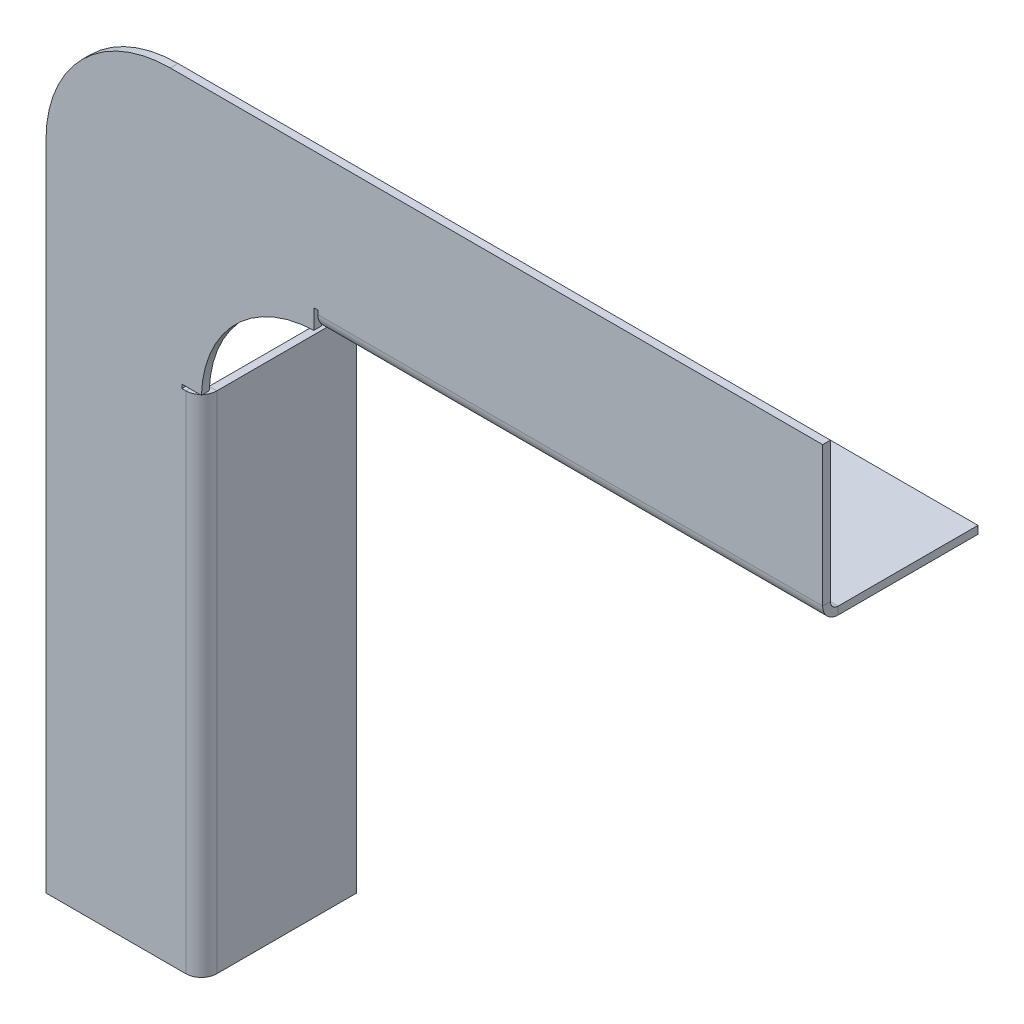
ISO-10303-21;
HEADER;
FILE_DESCRIPTION(('STEP AP214'),'2;1');
FILE_NAME('part.step','',(''),(''),'','','');
FILE_SCHEMA(('AUTOMOTIVE_DESIGN { 1 0 10303 214 1 1 1 1 }'));
ENDSEC;
DATA;
#1=APPLICATION_CONTEXT('core data for automotive mechanical design processes');
#2=APPLICATION_PROTOCOL_DEFINITION('international standard','automotive_design',2000,#1);
#3=PRODUCT_CONTEXT('',#1,'mechanical');
#4=PRODUCT('Part','Part','',(#3));
#5=PRODUCT_RELATED_PRODUCT_CATEGORY('part','',(#4));
#6=PRODUCT_DEFINITION_FORMATION('','',#4);
#7=PRODUCT_DEFINITION_CONTEXT('part definition',#1,'design');
#8=PRODUCT_DEFINITION('design','',#6,#7);
#9=PRODUCT_DEFINITION_SHAPE('','',#8);
#10=(LENGTH_UNIT() NAMED_UNIT(*) SI_UNIT(.MILLI.,.METRE.));
#11=(NAMED_UNIT(*) PLANE_ANGLE_UNIT() SI_UNIT($,.RADIAN.));
#12=(NAMED_UNIT(*) SI_UNIT($,.STERADIAN.) SOLID_ANGLE_UNIT());
#13=UNCERTAINTY_MEASURE_WITH_UNIT(LENGTH_MEASURE(1.E-05),#10,'distance_accuracy_value','');
#14=(GEOMETRIC_REPRESENTATION_CONTEXT(3) GLOBAL_UNCERTAINTY_ASSIGNED_CONTEXT((#13)) GLOBAL_UNIT_ASSIGNED_CONTEXT((#10,
#11,#12)) REPRESENTATION_CONTEXT('',''));
#15=CARTESIAN_POINT('',(0.,0.,0.));
#16=DIRECTION('',(0.,0.,1.));
#17=DIRECTION('',(1.,0.,0.));
#18=AXIS2_PLACEMENT_3D('',#15,#16,#17);
#19=CARTESIAN_POINT('',(19.,-19.,-1.));
#20=DIRECTION('',(0.,0.,1.));
#21=DIRECTION('',(1.,0.,0.));
#22=AXIS2_PLACEMENT_3D('',#19,#20,#21);
#23=CYLINDRICAL_SURFACE('',#22,15.);
#24=CARTESIAN_POINT('',(19.,-19.,0.));
#25=DIRECTION('',(0.,0.,-1.));
#26=DIRECTION('',(1.,0.,0.));
#27=AXIS2_PLACEMENT_3D('',#24,#25,#26);
#28=CIRCLE('',#27,15.);
#29=CARTESIAN_POINT('',(4.00833564943506,-18.5,0.));
#30=VERTEX_POINT('',#29);
#31=CARTESIAN_POINT('',(18.5,-4.00833564943506,0.));
#32=VERTEX_POINT('',#31);
#33=EDGE_CURVE('E471',#30,#32,#28,.T.);
#34=ORIENTED_EDGE('',*,*,#33,.F.);
#35=DIRECTION('',(0.,0.,1.));
#36=VECTOR('',#35,1.);
#37=CARTESIAN_POINT('',(4.00833564943506,-18.5,-1.));
#38=LINE('',#37,#36);
#39=CARTESIAN_POINT('',(4.00833564943506,-18.5,-1.));
#40=VERTEX_POINT('',#39);
#41=EDGE_CURVE('E407',#40,#30,#38,.T.);
#42=ORIENTED_EDGE('',*,*,#41,.F.);
#43=CARTESIAN_POINT('',(19.,-19.,-1.));
#44=DIRECTION('',(0.,0.,-1.));
#45=DIRECTION('',(1.,0.,0.));
#46=AXIS2_PLACEMENT_3D('',#43,#44,#45);
#47=CIRCLE('',#46,15.);
#48=CARTESIAN_POINT('',(18.5,-4.00833564943506,-1.));
#49=VERTEX_POINT('',#48);
#50=EDGE_CURVE('E451',#40,#49,#47,.T.);
#51=ORIENTED_EDGE('',*,*,#50,.T.);
#52=DIRECTION('',(0.,0.,1.));
#53=VECTOR('',#52,1.);
#54=CARTESIAN_POINT('',(18.5,-4.00833564943506,-1.));
#55=LINE('',#54,#53);
#56=EDGE_CURVE('E421',#49,#32,#55,.T.);
#57=ORIENTED_EDGE('',*,*,#56,.T.);
#58=EDGE_LOOP('',(#34,#42,#51,#57));
#59=FACE_BOUND('',#58,.T.);
#60=ADVANCED_FACE('F80',(#59),#23,.F.);
#61=CARTESIAN_POINT('',(0.,0.,-1.));
#62=DIRECTION('',(0.,0.,1.));
#63=DIRECTION('',(1.,0.,0.));
#64=AXIS2_PLACEMENT_3D('',#61,#62,#63);
#65=PLANE('',#64);
#66=DIRECTION('',(0.,-1.,0.));
#67=VECTOR('',#66,1.);
#68=CARTESIAN_POINT('',(2.00000000000001,-84.,-1.));
#69=LINE('',#68,#67);
#70=CARTESIAN_POINT('',(2.00000000000001,-84.,-1.));
#71=VERTEX_POINT('',#70);
#72=CARTESIAN_POINT('',(2.00000000000001,-19.,-1.));
#73=VERTEX_POINT('',#72);
#74=EDGE_CURVE('E309',#71,#73,#69,.F.);
#75=ORIENTED_EDGE('',*,*,#74,.F.);
#76=DIRECTION('',(1.,0.,0.));
#77=VECTOR('',#76,1.);
#78=CARTESIAN_POINT('',(-16.,-84.,-1.));
#79=LINE('',#78,#77);
#80=CARTESIAN_POINT('',(-16.,-84.,-1.));
#81=VERTEX_POINT('',#80);
#82=EDGE_CURVE('E447',#81,#71,#79,.T.);
#83=ORIENTED_EDGE('',*,*,#82,.F.);
#84=DIRECTION('',(0.,-1.,0.));
#85=VECTOR('',#84,1.);
#86=CARTESIAN_POINT('',(-16.,0.,-1.));
#87=LINE('',#86,#85);
#88=CARTESIAN_POINT('',(-16.,0.,-1.));
#89=VERTEX_POINT('',#88);
#90=EDGE_CURVE('E443',#89,#81,#87,.T.);
#91=ORIENTED_EDGE('',*,*,#90,.F.);
#92=CARTESIAN_POINT('',(0.,0.,-1.));
#93=DIRECTION('',(0.,0.,1.));
#94=DIRECTION('',(1.,0.,0.));
#95=AXIS2_PLACEMENT_3D('',#92,#93,#94);
#96=CIRCLE('',#95,16.);
#97=CARTESIAN_POINT('',(0.,16.,-1.));
#98=VERTEX_POINT('',#97);
#99=EDGE_CURVE('E440',#98,#89,#96,.T.);
#100=ORIENTED_EDGE('',*,*,#99,.F.);
#101=DIRECTION('',(-1.,0.,0.));
#102=VECTOR('',#101,1.);
#103=CARTESIAN_POINT('',(0.,16.,-1.));
#104=LINE('',#103,#102);
#105=CARTESIAN_POINT('',(84.,16.,-1.));
#106=VERTEX_POINT('',#105);
#107=EDGE_CURVE('E457',#106,#98,#104,.T.);
#108=ORIENTED_EDGE('',*,*,#107,.F.);
#109=DIRECTION('',(0.,1.,0.));
#110=VECTOR('',#109,1.);
#111=CARTESIAN_POINT('',(84.,16.,-1.));
#112=LINE('',#111,#110);
#113=CARTESIAN_POINT('',(84.,-2.00000000000001,-1.));
#114=VERTEX_POINT('',#113);
#115=EDGE_CURVE('E454',#114,#106,#112,.T.);
#116=ORIENTED_EDGE('',*,*,#115,.F.);
#117=DIRECTION('',(-1.,0.,0.));
#118=VECTOR('',#117,1.);
#119=CARTESIAN_POINT('',(19.,-2.00000000000001,-1.));
#120=LINE('',#119,#118);
#121=CARTESIAN_POINT('',(19.,-2.00000000000001,-1.));
#122=VERTEX_POINT('',#121);
#123=EDGE_CURVE('E381',#122,#114,#120,.F.);
#124=ORIENTED_EDGE('',*,*,#123,.F.);
#125=DIRECTION('',(0.,-1.,0.));
#126=VECTOR('',#125,1.);
#127=CARTESIAN_POINT('',(19.,-1.50000000000001,-1.));
#128=LINE('',#127,#126);
#129=CARTESIAN_POINT('',(19.,-1.50000000000001,-1.));
#130=VERTEX_POINT('',#129);
#131=EDGE_CURVE('E427',#130,#122,#128,.T.);
#132=ORIENTED_EDGE('',*,*,#131,.F.);
#133=DIRECTION('',(1.,0.,0.));
#134=VECTOR('',#133,1.);
#135=CARTESIAN_POINT('',(18.5,-1.50000000000001,-1.));
#136=LINE('',#135,#134);
#137=CARTESIAN_POINT('',(18.5,-1.50000000000001,-1.));
#138=VERTEX_POINT('',#137);
#139=EDGE_CURVE('E422',#138,#130,#136,.T.);
#140=ORIENTED_EDGE('',*,*,#139,.F.);
#141=DIRECTION('',(0.,1.,0.));
#142=VECTOR('',#141,1.);
#143=CARTESIAN_POINT('',(18.5,-4.00833564943506,-1.));
#144=LINE('',#143,#142);
#145=EDGE_CURVE('E416',#49,#138,#144,.T.);
#146=ORIENTED_EDGE('',*,*,#145,.F.);
#147=ORIENTED_EDGE('',*,*,#50,.F.);
#148=DIRECTION('',(1.,0.,0.));
#149=VECTOR('',#148,1.);
#150=CARTESIAN_POINT('',(1.50000000000001,-18.5,-1.));
#151=LINE('',#150,#149);
#152=CARTESIAN_POINT('',(1.50000000000001,-18.5,-1.));
#153=VERTEX_POINT('',#152);
#154=EDGE_CURVE('E404',#153,#40,#151,.T.);
#155=ORIENTED_EDGE('',*,*,#154,.F.);
#156=DIRECTION('',(0.,1.,0.));
#157=VECTOR('',#156,1.);
#158=CARTESIAN_POINT('',(1.50000000000001,-19.,-1.));
#159=LINE('',#158,#157);
#160=CARTESIAN_POINT('',(1.50000000000001,-19.,-1.));
#161=VERTEX_POINT('',#160);
#162=EDGE_CURVE('E399',#161,#153,#159,.T.);
#163=ORIENTED_EDGE('',*,*,#162,.F.);
#164=DIRECTION('',(-1.,0.,0.));
#165=VECTOR('',#164,1.);
#166=CARTESIAN_POINT('',(2.00000000000001,-19.,-1.));
#167=LINE('',#166,#165);
#168=EDGE_CURVE('E394',#73,#161,#167,.T.);
#169=ORIENTED_EDGE('',*,*,#168,.F.);
#170=EDGE_LOOP('',(#75,#83,#91,#100,#108,#116,#124,#132,#140,#146,#147,#155,#163,#169));
#171=FACE_BOUND('',#170,.T.);
#172=ADVANCED_FACE('F522',(#171),#65,.F.);
#173=CARTESIAN_POINT('',(0.,0.,0.));
#174=DIRECTION('',(0.,0.,1.));
#175=DIRECTION('',(1.,0.,0.));
#176=AXIS2_PLACEMENT_3D('',#173,#174,#175);
#177=PLANE('',#176);
#178=DIRECTION('',(1.,0.,0.));
#179=VECTOR('',#178,1.);
#180=CARTESIAN_POINT('',(-16.,-84.,0.));
#181=LINE('',#180,#179);
#182=CARTESIAN_POINT('',(-16.,-84.,0.));
#183=VERTEX_POINT('',#182);
#184=CARTESIAN_POINT('',(2.00000000000001,-84.,0.));
#185=VERTEX_POINT('',#184);
#186=EDGE_CURVE('E467',#183,#185,#181,.T.);
#187=ORIENTED_EDGE('',*,*,#186,.T.);
#188=DIRECTION('',(0.,-1.,0.));
#189=VECTOR('',#188,1.);
#190=CARTESIAN_POINT('',(2.00000000000001,-84.,0.));
#191=LINE('',#190,#189);
#192=CARTESIAN_POINT('',(2.00000000000001,-19.,0.));
#193=VERTEX_POINT('',#192);
#194=EDGE_CURVE('E292',#185,#193,#191,.F.);
#195=ORIENTED_EDGE('',*,*,#194,.T.);
#196=DIRECTION('',(-1.,0.,0.));
#197=VECTOR('',#196,1.);
#198=CARTESIAN_POINT('',(0.,-19.,0.));
#199=LINE('',#198,#197);
#200=CARTESIAN_POINT('',(1.50000000000001,-19.,0.));
#201=VERTEX_POINT('',#200);
#202=EDGE_CURVE('E13',#193,#201,#199,.T.);
#203=ORIENTED_EDGE('',*,*,#202,.T.);
#204=DIRECTION('',(0.,1.,0.));
#205=VECTOR('',#204,1.);
#206=CARTESIAN_POINT('',(1.50000000000001,0.,0.));
#207=LINE('',#206,#205);
#208=CARTESIAN_POINT('',(1.50000000000001,-18.5,0.));
#209=VERTEX_POINT('',#208);
#210=EDGE_CURVE('E89',#201,#209,#207,.T.);
#211=ORIENTED_EDGE('',*,*,#210,.T.);
#212=DIRECTION('',(1.,0.,0.));
#213=VECTOR('',#212,1.);
#214=CARTESIAN_POINT('',(0.,-18.5,0.));
#215=LINE('',#214,#213);
#216=EDGE_CURVE('E503',#209,#30,#215,.T.);
#217=ORIENTED_EDGE('',*,*,#216,.T.);
#218=ORIENTED_EDGE('',*,*,#33,.T.);
#219=DIRECTION('',(0.,1.,0.));
#220=VECTOR('',#219,1.);
#221=CARTESIAN_POINT('',(18.5,0.,0.));
#222=LINE('',#221,#220);
#223=CARTESIAN_POINT('',(18.5,-1.50000000000001,0.));
#224=VERTEX_POINT('',#223);
#225=EDGE_CURVE('E499',#32,#224,#222,.T.);
#226=ORIENTED_EDGE('',*,*,#225,.T.);
#227=DIRECTION('',(1.,0.,0.));
#228=VECTOR('',#227,1.);
#229=CARTESIAN_POINT('',(0.,-1.50000000000001,0.));
#230=LINE('',#229,#228);
#231=CARTESIAN_POINT('',(19.,-1.50000000000001,0.));
#232=VERTEX_POINT('',#231);
#233=EDGE_CURVE('E495',#224,#232,#230,.T.);
#234=ORIENTED_EDGE('',*,*,#233,.T.);
#235=DIRECTION('',(0.,-1.,0.));
#236=VECTOR('',#235,1.);
#237=CARTESIAN_POINT('',(19.,0.,0.));
#238=LINE('',#237,#236);
#239=CARTESIAN_POINT('',(19.,-2.00000000000002,0.));
#240=VERTEX_POINT('',#239);
#241=EDGE_CURVE('E482',#232,#240,#238,.T.);
#242=ORIENTED_EDGE('',*,*,#241,.T.);
#243=DIRECTION('',(-1.,0.,0.));
#244=VECTOR('',#243,1.);
#245=CARTESIAN_POINT('',(19.,-2.00000000000002,0.));
#246=LINE('',#245,#244);
#247=CARTESIAN_POINT('',(84.,-2.00000000000001,0.));
#248=VERTEX_POINT('',#247);
#249=EDGE_CURVE('E366',#240,#248,#246,.F.);
#250=ORIENTED_EDGE('',*,*,#249,.T.);
#251=DIRECTION('',(0.,1.,0.));
#252=VECTOR('',#251,1.);
#253=CARTESIAN_POINT('',(84.,16.,0.));
#254=LINE('',#253,#252);
#255=CARTESIAN_POINT('',(84.,16.,0.));
#256=VERTEX_POINT('',#255);
#257=EDGE_CURVE('E474',#248,#256,#254,.T.);
#258=ORIENTED_EDGE('',*,*,#257,.T.);
#259=DIRECTION('',(-1.,0.,0.));
#260=VECTOR('',#259,1.);
#261=CARTESIAN_POINT('',(0.,16.,0.));
#262=LINE('',#261,#260);
#263=CARTESIAN_POINT('',(0.,16.,0.));
#264=VERTEX_POINT('',#263);
#265=EDGE_CURVE('E444',#256,#264,#262,.T.);
#266=ORIENTED_EDGE('',*,*,#265,.T.);
#267=CARTESIAN_POINT('',(0.,0.,0.));
#268=DIRECTION('',(0.,0.,1.));
#269=DIRECTION('',(1.,0.,0.));
#270=AXIS2_PLACEMENT_3D('',#267,#268,#269);
#271=CIRCLE('',#270,16.);
#272=CARTESIAN_POINT('',(-16.,0.,0.));
#273=VERTEX_POINT('',#272);
#274=EDGE_CURVE('E420',#264,#273,#271,.T.);
#275=ORIENTED_EDGE('',*,*,#274,.T.);
#276=DIRECTION('',(0.,-1.,0.));
#277=VECTOR('',#276,1.);
#278=CARTESIAN_POINT('',(-16.,0.,0.));
#279=LINE('',#278,#277);
#280=EDGE_CURVE('E463',#273,#183,#279,.T.);
#281=ORIENTED_EDGE('',*,*,#280,.T.);
#282=EDGE_LOOP('',(#187,#195,#203,#211,#217,#218,#226,#234,#242,#250,#258,#266,#275,#281));
#283=FACE_BOUND('',#282,.T.);
#284=ADVANCED_FACE('F509',(#283),#177,.T.);
#285=CARTESIAN_POINT('',(-16.,-84.,-1.));
#286=DIRECTION('',(0.,-1.,0.));
#287=DIRECTION('',(0.,0.,-1.));
#288=AXIS2_PLACEMENT_3D('',#285,#286,#287);
#289=PLANE('',#288);
#290=ORIENTED_EDGE('',*,*,#82,.T.);
#291=DIRECTION('',(0.,0.,1.));
#292=VECTOR('',#291,1.);
#293=CARTESIAN_POINT('',(2.00000000000001,-84.,-1.));
#294=LINE('',#293,#292);
#295=EDGE_CURVE('E301',#71,#185,#294,.T.);
#296=ORIENTED_EDGE('',*,*,#295,.T.);
#297=ORIENTED_EDGE('',*,*,#186,.F.);
#298=DIRECTION('',(0.,0.,1.));
#299=VECTOR('',#298,1.);
#300=CARTESIAN_POINT('',(-16.,-84.,-1.));
#301=LINE('',#300,#299);
#302=EDGE_CURVE('E487',#81,#183,#301,.T.);
#303=ORIENTED_EDGE('',*,*,#302,.F.);
#304=EDGE_LOOP('',(#290,#296,#297,#303));
#305=FACE_BOUND('',#304,.T.);
#306=ADVANCED_FACE('F582',(#305),#289,.T.);
#307=CARTESIAN_POINT('',(0.,0.,-1.));
#308=DIRECTION('',(0.,0.,1.));
#309=DIRECTION('',(1.,0.,0.));
#310=AXIS2_PLACEMENT_3D('',#307,#308,#309);
#311=CYLINDRICAL_SURFACE('',#310,16.);
#312=ORIENTED_EDGE('',*,*,#274,.F.);
#313=DIRECTION('',(0.,0.,1.));
#314=VECTOR('',#313,1.);
#315=CARTESIAN_POINT('',(0.,16.,-1.));
#316=LINE('',#315,#314);
#317=EDGE_CURVE('E105',#98,#264,#316,.T.);
#318=ORIENTED_EDGE('',*,*,#317,.F.);
#319=ORIENTED_EDGE('',*,*,#99,.T.);
#320=DIRECTION('',(0.,0.,1.));
#321=VECTOR('',#320,1.);
#322=CARTESIAN_POINT('',(-16.,0.,-1.));
#323=LINE('',#322,#321);
#324=EDGE_CURVE('E131',#89,#273,#323,.T.);
#325=ORIENTED_EDGE('',*,*,#324,.T.);
#326=EDGE_LOOP('',(#312,#318,#319,#325));
#327=FACE_BOUND('',#326,.T.);
#328=ADVANCED_FACE('F82',(#327),#311,.T.);
#329=CARTESIAN_POINT('',(0.,16.,-1.));
#330=DIRECTION('',(0.,1.,0.));
#331=DIRECTION('',(0.,0.,1.));
#332=AXIS2_PLACEMENT_3D('',#329,#330,#331);
#333=PLANE('',#332);
#334=ORIENTED_EDGE('',*,*,#265,.F.);
#335=DIRECTION('',(0.,0.,1.));
#336=VECTOR('',#335,1.);
#337=CARTESIAN_POINT('',(84.,16.,-1.));
#338=LINE('',#337,#336);
#339=EDGE_CURVE('E483',#106,#256,#338,.T.);
#340=ORIENTED_EDGE('',*,*,#339,.F.);
#341=ORIENTED_EDGE('',*,*,#107,.T.);
#342=ORIENTED_EDGE('',*,*,#317,.T.);
#343=EDGE_LOOP('',(#334,#340,#341,#342));
#344=FACE_BOUND('',#343,.T.);
#345=ADVANCED_FACE('F577',(#344),#333,.T.);
#346=CARTESIAN_POINT('',(84.,16.,-1.));
#347=DIRECTION('',(1.,0.,0.));
#348=DIRECTION('',(0.,0.,-1.));
#349=AXIS2_PLACEMENT_3D('',#346,#347,#348);
#350=PLANE('',#349);
#351=DIRECTION('',(0.,0.,1.));
#352=VECTOR('',#351,1.);
#353=CARTESIAN_POINT('',(84.,-2.00000000000001,-1.));
#354=LINE('',#353,#352);
#355=EDGE_CURVE('E387',#114,#248,#354,.T.);
#356=ORIENTED_EDGE('',*,*,#355,.F.);
#357=ORIENTED_EDGE('',*,*,#115,.T.);
#358=ORIENTED_EDGE('',*,*,#339,.T.);
#359=ORIENTED_EDGE('',*,*,#257,.F.);
#360=EDGE_LOOP('',(#356,#357,#358,#359));
#361=FACE_BOUND('',#360,.T.);
#362=ADVANCED_FACE('F574',(#361),#350,.T.);
#363=CARTESIAN_POINT('',(-16.,0.,-1.));
#364=DIRECTION('',(-1.,0.,0.));
#365=DIRECTION('',(0.,-1.,0.));
#366=AXIS2_PLACEMENT_3D('',#363,#364,#365);
#367=PLANE('',#366);
#368=ORIENTED_EDGE('',*,*,#280,.F.);
#369=ORIENTED_EDGE('',*,*,#324,.F.);
#370=ORIENTED_EDGE('',*,*,#90,.T.);
#371=ORIENTED_EDGE('',*,*,#302,.T.);
#372=EDGE_LOOP('',(#368,#369,#370,#371));
#373=FACE_BOUND('',#372,.T.);
#374=ADVANCED_FACE('F578',(#373),#367,.T.);
#375=CARTESIAN_POINT('',(18.5,-4.00833564943506,-1.));
#376=DIRECTION('',(1.,0.,0.));
#377=DIRECTION('',(0.,0.,-1.));
#378=AXIS2_PLACEMENT_3D('',#375,#376,#377);
#379=PLANE('',#378);
#380=ORIENTED_EDGE('',*,*,#225,.F.);
#381=ORIENTED_EDGE('',*,*,#56,.F.);
#382=ORIENTED_EDGE('',*,*,#145,.T.);
#383=DIRECTION('',(0.,0.,1.));
#384=VECTOR('',#383,1.);
#385=CARTESIAN_POINT('',(18.5,-1.50000000000001,-1.));
#386=LINE('',#385,#384);
#387=EDGE_CURVE('E426',#138,#224,#386,.T.);
#388=ORIENTED_EDGE('',*,*,#387,.T.);
#389=EDGE_LOOP('',(#380,#381,#382,#388));
#390=FACE_BOUND('',#389,.T.);
#391=ADVANCED_FACE('F532',(#390),#379,.T.);
#392=CARTESIAN_POINT('',(18.5,-1.50000000000001,-1.));
#393=DIRECTION('',(0.,-1.,0.));
#394=DIRECTION('',(0.,0.,-1.));
#395=AXIS2_PLACEMENT_3D('',#392,#393,#394);
#396=PLANE('',#395);
#397=ORIENTED_EDGE('',*,*,#233,.F.);
#398=ORIENTED_EDGE('',*,*,#387,.F.);
#399=ORIENTED_EDGE('',*,*,#139,.T.);
#400=DIRECTION('',(0.,0.,1.));
#401=VECTOR('',#400,1.);
#402=CARTESIAN_POINT('',(19.,-1.50000000000001,-1.));
#403=LINE('',#402,#401);
#404=EDGE_CURVE('E398',#130,#232,#403,.T.);
#405=ORIENTED_EDGE('',*,*,#404,.T.);
#406=EDGE_LOOP('',(#397,#398,#399,#405));
#407=FACE_BOUND('',#406,.T.);
#408=ADVANCED_FACE('F535',(#407),#396,.T.);
#409=CARTESIAN_POINT('',(19.,-1.50000000000001,-1.));
#410=DIRECTION('',(-1.,0.,0.));
#411=DIRECTION('',(0.,0.,1.));
#412=AXIS2_PLACEMENT_3D('',#409,#410,#411);
#413=PLANE('',#412);
#414=ORIENTED_EDGE('',*,*,#241,.F.);
#415=ORIENTED_EDGE('',*,*,#404,.F.);
#416=ORIENTED_EDGE('',*,*,#131,.T.);
#417=DIRECTION('',(0.,0.,1.));
#418=VECTOR('',#417,1.);
#419=CARTESIAN_POINT('',(19.,-2.00000000000001,-1.));
#420=LINE('',#419,#418);
#421=EDGE_CURVE('E373',#122,#240,#420,.T.);
#422=ORIENTED_EDGE('',*,*,#421,.T.);
#423=EDGE_LOOP('',(#414,#415,#416,#422));
#424=FACE_BOUND('',#423,.T.);
#425=ADVANCED_FACE('F539',(#424),#413,.T.);
#426=CARTESIAN_POINT('',(2.00000000000001,-19.,-1.));
#427=DIRECTION('',(0.,1.,0.));
#428=DIRECTION('',(0.,0.,1.));
#429=AXIS2_PLACEMENT_3D('',#426,#427,#428);
#430=PLANE('',#429);
#431=ORIENTED_EDGE('',*,*,#202,.F.);
#432=DIRECTION('',(0.,0.,1.));
#433=VECTOR('',#432,1.);
#434=CARTESIAN_POINT('',(2.00000000000001,-19.,-1.));
#435=LINE('',#434,#433);
#436=EDGE_CURVE('E316',#73,#193,#435,.T.);
#437=ORIENTED_EDGE('',*,*,#436,.F.);
#438=ORIENTED_EDGE('',*,*,#168,.T.);
#439=DIRECTION('',(0.,0.,1.));
#440=VECTOR('',#439,1.);
#441=CARTESIAN_POINT('',(1.50000000000001,-19.,-1.));
#442=LINE('',#441,#440);
#443=EDGE_CURVE('E403',#161,#201,#442,.T.);
#444=ORIENTED_EDGE('',*,*,#443,.T.);
#445=EDGE_LOOP('',(#431,#437,#438,#444));
#446=FACE_BOUND('',#445,.T.);
#447=ADVANCED_FACE('F515',(#446),#430,.T.);
#448=CARTESIAN_POINT('',(1.50000000000001,-19.,-1.));
#449=DIRECTION('',(1.,0.,0.));
#450=DIRECTION('',(0.,0.,-1.));
#451=AXIS2_PLACEMENT_3D('',#448,#449,#450);
#452=PLANE('',#451);
#453=ORIENTED_EDGE('',*,*,#210,.F.);
#454=ORIENTED_EDGE('',*,*,#443,.F.);
#455=ORIENTED_EDGE('',*,*,#162,.T.);
#456=DIRECTION('',(0.,0.,1.));
#457=VECTOR('',#456,1.);
#458=CARTESIAN_POINT('',(1.50000000000001,-18.5,-1.));
#459=LINE('',#458,#457);
#460=EDGE_CURVE('E390',#153,#209,#459,.T.);
#461=ORIENTED_EDGE('',*,*,#460,.T.);
#462=EDGE_LOOP('',(#453,#454,#455,#461));
#463=FACE_BOUND('',#462,.T.);
#464=ADVANCED_FACE('F513',(#463),#452,.T.);
#465=CARTESIAN_POINT('',(1.50000000000001,-18.5,-1.));
#466=DIRECTION('',(0.,-1.,0.));
#467=DIRECTION('',(0.,0.,-1.));
#468=AXIS2_PLACEMENT_3D('',#465,#466,#467);
#469=PLANE('',#468);
#470=ORIENTED_EDGE('',*,*,#216,.F.);
#471=ORIENTED_EDGE('',*,*,#460,.F.);
#472=ORIENTED_EDGE('',*,*,#154,.T.);
#473=ORIENTED_EDGE('',*,*,#41,.T.);
#474=EDGE_LOOP('',(#470,#471,#472,#473));
#475=FACE_BOUND('',#474,.T.);
#476=ADVANCED_FACE('F527',(#475),#469,.T.);
#477=CARTESIAN_POINT('',(84.,-2.00000000000001,-2.));
#478=DIRECTION('',(1.,0.,0.));
#479=DIRECTION('',(0.,0.,-1.));
#480=AXIS2_PLACEMENT_3D('',#477,#478,#479);
#481=PLANE('',#480);
#482=DIRECTION('',(0.,1.,0.));
#483=VECTOR('',#482,1.);
#484=CARTESIAN_POINT('',(84.,-4.,-1.99999999999999));
#485=LINE('',#484,#483);
#486=CARTESIAN_POINT('',(84.,-3.,-1.99999999999999));
#487=VERTEX_POINT('',#486);
#488=CARTESIAN_POINT('',(84.,-4.,-1.99999999999999));
#489=VERTEX_POINT('',#488);
#490=EDGE_CURVE('E320',#487,#489,#485,.F.);
#491=ORIENTED_EDGE('',*,*,#490,.F.);
#492=CARTESIAN_POINT('',(84.,-2.00000000000001,-2.));
#493=DIRECTION('',(-1.,0.,0.));
#494=DIRECTION('',(0.,0.,1.));
#495=AXIS2_PLACEMENT_3D('',#492,#493,#494);
#496=CIRCLE('',#495,0.999999999999997);
#497=EDGE_CURVE('E377',#114,#487,#496,.F.);
#498=ORIENTED_EDGE('',*,*,#497,.F.);
#499=ORIENTED_EDGE('',*,*,#355,.T.);
#500=CARTESIAN_POINT('',(84.,-2.00000000000001,-2.));
#501=DIRECTION('',(-1.,0.,0.));
#502=DIRECTION('',(0.,0.,1.));
#503=AXIS2_PLACEMENT_3D('',#500,#501,#502);
#504=CIRCLE('',#503,2.);
#505=EDGE_CURVE('E96',#248,#489,#504,.F.);
#506=ORIENTED_EDGE('',*,*,#505,.T.);
#507=EDGE_LOOP('',(#491,#498,#499,#506));
#508=FACE_BOUND('',#507,.T.);
#509=ADVANCED_FACE('F570',(#508),#481,.T.);
#510=CARTESIAN_POINT('',(19.,-2.00000000000001,-2.));
#511=DIRECTION('',(1.,0.,0.));
#512=DIRECTION('',(0.,0.,-1.));
#513=AXIS2_PLACEMENT_3D('',#510,#511,#512);
#514=PLANE('',#513);
#515=CARTESIAN_POINT('',(19.,-2.00000000000001,-2.));
#516=DIRECTION('',(-1.,0.,0.));
#517=DIRECTION('',(0.,0.,1.));
#518=AXIS2_PLACEMENT_3D('',#515,#516,#517);
#519=CIRCLE('',#518,0.999999999999997);
#520=CARTESIAN_POINT('',(19.,-3.,-1.99999999999999));
#521=VERTEX_POINT('',#520);
#522=EDGE_CURVE('E328',#521,#122,#519,.T.);
#523=ORIENTED_EDGE('',*,*,#522,.F.);
#524=DIRECTION('',(0.,1.,0.));
#525=VECTOR('',#524,1.);
#526=CARTESIAN_POINT('',(19.,-3.00000000000001,-1.99999999999999));
#527=LINE('',#526,#525);
#528=CARTESIAN_POINT('',(19.,-4.00000000000001,-1.99999999999999));
#529=VERTEX_POINT('',#528);
#530=EDGE_CURVE('E356',#521,#529,#527,.F.);
#531=ORIENTED_EDGE('',*,*,#530,.T.);
#532=CARTESIAN_POINT('',(19.,-2.00000000000001,-2.));
#533=DIRECTION('',(-1.,0.,0.));
#534=DIRECTION('',(0.,0.,1.));
#535=AXIS2_PLACEMENT_3D('',#532,#533,#534);
#536=CIRCLE('',#535,2.);
#537=EDGE_CURVE('E370',#529,#240,#536,.T.);
#538=ORIENTED_EDGE('',*,*,#537,.T.);
#539=ORIENTED_EDGE('',*,*,#421,.F.);
#540=EDGE_LOOP('',(#523,#531,#538,#539));
#541=FACE_BOUND('',#540,.T.);
#542=ADVANCED_FACE('F543',(#541),#514,.F.);
#543=CARTESIAN_POINT('',(19.,-2.00000000000001,-2.));
#544=DIRECTION('',(-1.,0.,0.));
#545=DIRECTION('',(0.,-1.,0.));
#546=AXIS2_PLACEMENT_3D('',#543,#544,#545);
#547=CYLINDRICAL_SURFACE('',#546,2.);
#548=ORIENTED_EDGE('',*,*,#249,.F.);
#549=ORIENTED_EDGE('',*,*,#537,.F.);
#550=DIRECTION('',(-1.,0.,0.));
#551=VECTOR('',#550,1.);
#552=CARTESIAN_POINT('',(84.,-4.,-1.99999999999999));
#553=LINE('',#552,#551);
#554=EDGE_CURVE('E353',#529,#489,#553,.F.);
#555=ORIENTED_EDGE('',*,*,#554,.T.);
#556=ORIENTED_EDGE('',*,*,#505,.F.);
#557=EDGE_LOOP('',(#548,#549,#555,#556));
#558=FACE_BOUND('',#557,.T.);
#559=ADVANCED_FACE('F568',(#558),#547,.T.);
#560=CARTESIAN_POINT('',(19.,-2.00000000000001,-2.));
#561=DIRECTION('',(-1.,0.,0.));
#562=DIRECTION('',(0.,-1.,0.));
#563=AXIS2_PLACEMENT_3D('',#560,#561,#562);
#564=CYLINDRICAL_SURFACE('',#563,0.999999999999997);
#565=ORIENTED_EDGE('',*,*,#123,.T.);
#566=ORIENTED_EDGE('',*,*,#497,.T.);
#567=DIRECTION('',(-1.,0.,0.));
#568=VECTOR('',#567,1.);
#569=CARTESIAN_POINT('',(84.,-3.,-2.));
#570=LINE('',#569,#568);
#571=EDGE_CURVE('E360',#487,#521,#570,.T.);
#572=ORIENTED_EDGE('',*,*,#571,.T.);
#573=ORIENTED_EDGE('',*,*,#522,.T.);
#574=EDGE_LOOP('',(#565,#566,#572,#573));
#575=FACE_BOUND('',#574,.T.);
#576=ADVANCED_FACE('F546',(#575),#564,.F.);
#577=CARTESIAN_POINT('',(19.,-4.00000000000007,-20.));
#578=DIRECTION('',(1.,0.,0.));
#579=DIRECTION('',(0.,0.,-1.));
#580=AXIS2_PLACEMENT_3D('',#577,#578,#579);
#581=PLANE('',#580);
#582=ORIENTED_EDGE('',*,*,#530,.F.);
#583=DIRECTION('',(0.,0.,1.));
#584=VECTOR('',#583,1.);
#585=CARTESIAN_POINT('',(19.,-3.00000000000007,-20.));
#586=LINE('',#585,#584);
#587=CARTESIAN_POINT('',(19.,-3.00000000000007,-20.));
#588=VERTEX_POINT('',#587);
#589=EDGE_CURVE('E350',#521,#588,#586,.F.);
#590=ORIENTED_EDGE('',*,*,#589,.T.);
#591=DIRECTION('',(0.,1.,0.));
#592=VECTOR('',#591,1.);
#593=CARTESIAN_POINT('',(19.,-4.00000000000007,-20.));
#594=LINE('',#593,#592);
#595=CARTESIAN_POINT('',(19.,-4.00000000000007,-20.));
#596=VERTEX_POINT('',#595);
#597=EDGE_CURVE('E324',#596,#588,#594,.T.);
#598=ORIENTED_EDGE('',*,*,#597,.F.);
#599=DIRECTION('',(0.,0.,-1.));
#600=VECTOR('',#599,1.);
#601=CARTESIAN_POINT('',(19.,-4.,0.));
#602=LINE('',#601,#600);
#603=EDGE_CURVE('E340',#529,#596,#602,.T.);
#604=ORIENTED_EDGE('',*,*,#603,.F.);
#605=EDGE_LOOP('',(#582,#590,#598,#604));
#606=FACE_BOUND('',#605,.T.);
#607=ADVANCED_FACE('F564',(#606),#581,.F.);
#608=CARTESIAN_POINT('',(84.,-4.,-0.999999999999997));
#609=DIRECTION('',(-1.,0.,0.));
#610=DIRECTION('',(0.,-1.,0.));
#611=AXIS2_PLACEMENT_3D('',#608,#609,#610);
#612=PLANE('',#611);
#613=ORIENTED_EDGE('',*,*,#490,.T.);
#614=DIRECTION('',(0.,0.,1.));
#615=VECTOR('',#614,1.);
#616=CARTESIAN_POINT('',(84.,-4.,0.));
#617=LINE('',#616,#615);
#618=CARTESIAN_POINT('',(84.,-4.00000000000007,-20.));
#619=VERTEX_POINT('',#618);
#620=EDGE_CURVE('E333',#619,#489,#617,.T.);
#621=ORIENTED_EDGE('',*,*,#620,.F.);
#622=DIRECTION('',(0.,1.,0.));
#623=VECTOR('',#622,1.);
#624=CARTESIAN_POINT('',(84.,-4.00000000000007,-20.));
#625=LINE('',#624,#623);
#626=CARTESIAN_POINT('',(84.,-3.00000000000007,-20.));
#627=VERTEX_POINT('',#626);
#628=EDGE_CURVE('E329',#619,#627,#625,.T.);
#629=ORIENTED_EDGE('',*,*,#628,.T.);
#630=DIRECTION('',(0.,0.,-1.));
#631=VECTOR('',#630,1.);
#632=CARTESIAN_POINT('',(84.,-3.,-1.));
#633=LINE('',#632,#631);
#634=EDGE_CURVE('E343',#627,#487,#633,.F.);
#635=ORIENTED_EDGE('',*,*,#634,.T.);
#636=EDGE_LOOP('',(#613,#621,#629,#635));
#637=FACE_BOUND('',#636,.T.);
#638=ADVANCED_FACE('F555',(#637),#612,.F.);
#639=CARTESIAN_POINT('',(0.,-4.00000000000001,0.));
#640=DIRECTION('',(0.,1.,0.));
#641=DIRECTION('',(0.,0.,1.));
#642=AXIS2_PLACEMENT_3D('',#639,#640,#641);
#643=PLANE('',#642);
#644=ORIENTED_EDGE('',*,*,#554,.F.);
#645=ORIENTED_EDGE('',*,*,#603,.T.);
#646=DIRECTION('',(1.,0.,0.));
#647=VECTOR('',#646,1.);
#648=CARTESIAN_POINT('',(0.,-4.00000000000007,-20.));
#649=LINE('',#648,#647);
#650=EDGE_CURVE('E337',#596,#619,#649,.T.);
#651=ORIENTED_EDGE('',*,*,#650,.T.);
#652=ORIENTED_EDGE('',*,*,#620,.T.);
#653=EDGE_LOOP('',(#644,#645,#651,#652));
#654=FACE_BOUND('',#653,.T.);
#655=ADVANCED_FACE('F567',(#654),#643,.F.);
#656=CARTESIAN_POINT('',(0.,-3.00000000000001,0.));
#657=DIRECTION('',(0.,1.,0.));
#658=DIRECTION('',(0.,0.,1.));
#659=AXIS2_PLACEMENT_3D('',#656,#657,#658);
#660=PLANE('',#659);
#661=ORIENTED_EDGE('',*,*,#589,.F.);
#662=ORIENTED_EDGE('',*,*,#571,.F.);
#663=ORIENTED_EDGE('',*,*,#634,.F.);
#664=DIRECTION('',(-1.,0.,0.));
#665=VECTOR('',#664,1.);
#666=CARTESIAN_POINT('',(84.,-3.00000000000007,-20.));
#667=LINE('',#666,#665);
#668=EDGE_CURVE('E347',#588,#627,#667,.F.);
#669=ORIENTED_EDGE('',*,*,#668,.F.);
#670=EDGE_LOOP('',(#661,#662,#663,#669));
#671=FACE_BOUND('',#670,.T.);
#672=ADVANCED_FACE('F552',(#671),#660,.T.);
#673=CARTESIAN_POINT('',(84.,-4.00000000000007,-20.));
#674=DIRECTION('',(0.,0.,1.));
#675=DIRECTION('',(0.,-1.,0.));
#676=AXIS2_PLACEMENT_3D('',#673,#674,#675);
#677=PLANE('',#676);
#678=ORIENTED_EDGE('',*,*,#668,.T.);
#679=ORIENTED_EDGE('',*,*,#628,.F.);
#680=ORIENTED_EDGE('',*,*,#650,.F.);
#681=ORIENTED_EDGE('',*,*,#597,.T.);
#682=EDGE_LOOP('',(#678,#679,#680,#681));
#683=FACE_BOUND('',#682,.T.);
#684=ADVANCED_FACE('F560',(#683),#677,.F.);
#685=CARTESIAN_POINT('',(2.00000000000001,-19.,-2.));
#686=DIRECTION('',(0.,1.,0.));
#687=DIRECTION('',(0.,0.,1.));
#688=AXIS2_PLACEMENT_3D('',#685,#686,#687);
#689=PLANE('',#688);
#690=DIRECTION('',(-1.,0.,0.));
#691=VECTOR('',#690,1.);
#692=CARTESIAN_POINT('',(4.00000000000001,-19.,-1.99999999999999));
#693=LINE('',#692,#691);
#694=CARTESIAN_POINT('',(3.00000000000001,-19.,-2.));
#695=VERTEX_POINT('',#694);
#696=CARTESIAN_POINT('',(4.00000000000001,-19.,-1.99999999999999));
#697=VERTEX_POINT('',#696);
#698=EDGE_CURVE('E265',#695,#697,#693,.F.);
#699=ORIENTED_EDGE('',*,*,#698,.F.);
#700=CARTESIAN_POINT('',(2.00000000000001,-19.,-2.));
#701=DIRECTION('',(0.,-1.,0.));
#702=DIRECTION('',(0.,0.,-1.));
#703=AXIS2_PLACEMENT_3D('',#700,#701,#702);
#704=CIRCLE('',#703,1.);
#705=EDGE_CURVE('E305',#73,#695,#704,.F.);
#706=ORIENTED_EDGE('',*,*,#705,.F.);
#707=ORIENTED_EDGE('',*,*,#436,.T.);
#708=CARTESIAN_POINT('',(2.00000000000001,-19.,-2.));
#709=DIRECTION('',(0.,-1.,0.));
#710=DIRECTION('',(0.,0.,-1.));
#711=AXIS2_PLACEMENT_3D('',#708,#709,#710);
#712=CIRCLE('',#711,2.);
#713=EDGE_CURVE('E296',#193,#697,#712,.F.);
#714=ORIENTED_EDGE('',*,*,#713,.T.);
#715=EDGE_LOOP('',(#699,#706,#707,#714));
#716=FACE_BOUND('',#715,.T.);
#717=ADVANCED_FACE('F600',(#716),#689,.T.);
#718=CARTESIAN_POINT('',(2.00000000000001,-84.,-2.));
#719=DIRECTION('',(0.,1.,0.));
#720=DIRECTION('',(0.,0.,1.));
#721=AXIS2_PLACEMENT_3D('',#718,#719,#720);
#722=PLANE('',#721);
#723=CARTESIAN_POINT('',(2.00000000000001,-84.,-2.));
#724=DIRECTION('',(0.,-1.,0.));
#725=DIRECTION('',(0.,0.,-1.));
#726=AXIS2_PLACEMENT_3D('',#723,#724,#725);
#727=CIRCLE('',#726,1.);
#728=CARTESIAN_POINT('',(3.00000000000001,-84.,-2.));
#729=VERTEX_POINT('',#728);
#730=EDGE_CURVE('E312',#729,#71,#727,.T.);
#731=ORIENTED_EDGE('',*,*,#730,.F.);
#732=DIRECTION('',(-1.,0.,0.));
#733=VECTOR('',#732,1.);
#734=CARTESIAN_POINT('',(3.00000000000001,-84.,-2.));
#735=LINE('',#734,#733);
#736=CARTESIAN_POINT('',(4.00000000000001,-84.,-1.99999999999999));
#737=VERTEX_POINT('',#736);
#738=EDGE_CURVE('E283',#729,#737,#735,.F.);
#739=ORIENTED_EDGE('',*,*,#738,.T.);
#740=CARTESIAN_POINT('',(2.00000000000001,-84.,-2.));
#741=DIRECTION('',(0.,-1.,0.));
#742=DIRECTION('',(0.,0.,-1.));
#743=AXIS2_PLACEMENT_3D('',#740,#741,#742);
#744=CIRCLE('',#743,2.);
#745=EDGE_CURVE('E297',#737,#185,#744,.T.);
#746=ORIENTED_EDGE('',*,*,#745,.T.);
#747=ORIENTED_EDGE('',*,*,#295,.F.);
#748=EDGE_LOOP('',(#731,#739,#746,#747));
#749=FACE_BOUND('',#748,.T.);
#750=ADVANCED_FACE('F587',(#749),#722,.F.);
#751=CARTESIAN_POINT('',(2.00000000000001,-84.,-2.));
#752=DIRECTION('',(0.,-1.,0.));
#753=DIRECTION('',(1.,0.,0.));
#754=AXIS2_PLACEMENT_3D('',#751,#752,#753);
#755=CYLINDRICAL_SURFACE('',#754,2.);
#756=ORIENTED_EDGE('',*,*,#194,.F.);
#757=ORIENTED_EDGE('',*,*,#745,.F.);
#758=DIRECTION('',(0.,-1.,0.));
#759=VECTOR('',#758,1.);
#760=CARTESIAN_POINT('',(4.00000000000001,-19.,-1.99999999999999));
#761=LINE('',#760,#759);
#762=EDGE_CURVE('E280',#737,#697,#761,.F.);
#763=ORIENTED_EDGE('',*,*,#762,.T.);
#764=ORIENTED_EDGE('',*,*,#713,.F.);
#765=EDGE_LOOP('',(#756,#757,#763,#764));
#766=FACE_BOUND('',#765,.T.);
#767=ADVANCED_FACE('F584',(#766),#755,.T.);
#768=CARTESIAN_POINT('',(2.00000000000001,-84.,-2.));
#769=DIRECTION('',(0.,-1.,0.));
#770=DIRECTION('',(1.,0.,0.));
#771=AXIS2_PLACEMENT_3D('',#768,#769,#770);
#772=CYLINDRICAL_SURFACE('',#771,1.);
#773=ORIENTED_EDGE('',*,*,#74,.T.);
#774=ORIENTED_EDGE('',*,*,#705,.T.);
#775=DIRECTION('',(0.,-1.,0.));
#776=VECTOR('',#775,1.);
#777=CARTESIAN_POINT('',(3.00000000000001,-19.,-2.));
#778=LINE('',#777,#776);
#779=EDGE_CURVE('E287',#695,#729,#778,.T.);
#780=ORIENTED_EDGE('',*,*,#779,.T.);
#781=ORIENTED_EDGE('',*,*,#730,.T.);
#782=EDGE_LOOP('',(#773,#774,#780,#781));
#783=FACE_BOUND('',#782,.T.);
#784=ADVANCED_FACE('F597',(#783),#772,.F.);
#785=CARTESIAN_POINT('',(4.00000000000008,-84.,-20.));
#786=DIRECTION('',(0.,1.,0.));
#787=DIRECTION('',(0.,0.,1.));
#788=AXIS2_PLACEMENT_3D('',#785,#786,#787);
#789=PLANE('',#788);
#790=ORIENTED_EDGE('',*,*,#738,.F.);
#791=DIRECTION('',(0.,0.,1.));
#792=VECTOR('',#791,1.);
#793=CARTESIAN_POINT('',(3.00000000000008,-84.,-20.));
#794=LINE('',#793,#792);
#795=CARTESIAN_POINT('',(3.00000000000008,-84.,-20.));
#796=VERTEX_POINT('',#795);
#797=EDGE_CURVE('E277',#729,#796,#794,.F.);
#798=ORIENTED_EDGE('',*,*,#797,.T.);
#799=DIRECTION('',(-1.,0.,0.));
#800=VECTOR('',#799,1.);
#801=CARTESIAN_POINT('',(4.00000000000008,-84.,-20.));
#802=LINE('',#801,#800);
#803=CARTESIAN_POINT('',(4.00000000000008,-84.,-20.));
#804=VERTEX_POINT('',#803);
#805=EDGE_CURVE('E261',#804,#796,#802,.T.);
#806=ORIENTED_EDGE('',*,*,#805,.F.);
#807=DIRECTION('',(0.,0.,-1.));
#808=VECTOR('',#807,1.);
#809=CARTESIAN_POINT('',(4.00000000000001,-84.,0.));
#810=LINE('',#809,#808);
#811=EDGE_CURVE('E246',#737,#804,#810,.T.);
#812=ORIENTED_EDGE('',*,*,#811,.F.);
#813=EDGE_LOOP('',(#790,#798,#806,#812));
#814=FACE_BOUND('',#813,.T.);
#815=ADVANCED_FACE('F591',(#814),#789,.F.);
#816=CARTESIAN_POINT('',(4.00000000000001,-19.,-0.999999999999997));
#817=DIRECTION('',(0.,-1.,0.));
#818=DIRECTION('',(0.,0.,-1.));
#819=AXIS2_PLACEMENT_3D('',#816,#817,#818);
#820=PLANE('',#819);
#821=ORIENTED_EDGE('',*,*,#698,.T.);
#822=DIRECTION('',(0.,0.,1.));
#823=VECTOR('',#822,1.);
#824=CARTESIAN_POINT('',(4.00000000000001,-19.,0.));
#825=LINE('',#824,#823);
#826=CARTESIAN_POINT('',(4.00000000000008,-19.,-20.));
#827=VERTEX_POINT('',#826);
#828=EDGE_CURVE('E244',#827,#697,#825,.T.);
#829=ORIENTED_EDGE('',*,*,#828,.F.);
#830=DIRECTION('',(-1.,0.,0.));
#831=VECTOR('',#830,1.);
#832=CARTESIAN_POINT('',(4.00000000000008,-19.,-20.));
#833=LINE('',#832,#831);
#834=CARTESIAN_POINT('',(3.00000000000008,-19.,-20.));
#835=VERTEX_POINT('',#834);
#836=EDGE_CURVE('E253',#827,#835,#833,.T.);
#837=ORIENTED_EDGE('',*,*,#836,.T.);
#838=DIRECTION('',(0.,0.,-1.));
#839=VECTOR('',#838,1.);
#840=CARTESIAN_POINT('',(3.00000000000001,-19.,-1.));
#841=LINE('',#840,#839);
#842=EDGE_CURVE('E272',#835,#695,#841,.F.);
#843=ORIENTED_EDGE('',*,*,#842,.T.);
#844=EDGE_LOOP('',(#821,#829,#837,#843));
#845=FACE_BOUND('',#844,.T.);
#846=ADVANCED_FACE('F264',(#845),#820,.F.);
#847=CARTESIAN_POINT('',(4.00000000000001,0.,0.));
#848=DIRECTION('',(-1.,0.,0.));
#849=DIRECTION('',(0.,0.,1.));
#850=AXIS2_PLACEMENT_3D('',#847,#848,#849);
#851=PLANE('',#850);
#852=ORIENTED_EDGE('',*,*,#762,.F.);
#853=ORIENTED_EDGE('',*,*,#811,.T.);
#854=DIRECTION('',(0.,1.,0.));
#855=VECTOR('',#854,1.);
#856=CARTESIAN_POINT('',(4.00000000000008,0.,-20.));
#857=LINE('',#856,#855);
#858=EDGE_CURVE('E239',#804,#827,#857,.T.);
#859=ORIENTED_EDGE('',*,*,#858,.T.);
#860=ORIENTED_EDGE('',*,*,#828,.T.);
#861=EDGE_LOOP('',(#852,#853,#859,#860));
#862=FACE_BOUND('',#861,.T.);
#863=ADVANCED_FACE('F242',(#862),#851,.F.);
#864=CARTESIAN_POINT('',(3.00000000000001,0.,0.));
#865=DIRECTION('',(-1.,0.,0.));
#866=DIRECTION('',(0.,0.,1.));
#867=AXIS2_PLACEMENT_3D('',#864,#865,#866);
#868=PLANE('',#867);
#869=ORIENTED_EDGE('',*,*,#797,.F.);
#870=ORIENTED_EDGE('',*,*,#779,.F.);
#871=ORIENTED_EDGE('',*,*,#842,.F.);
#872=DIRECTION('',(0.,-1.,0.));
#873=VECTOR('',#872,1.);
#874=CARTESIAN_POINT('',(3.00000000000008,-19.,-20.));
#875=LINE('',#874,#873);
#876=EDGE_CURVE('E256',#796,#835,#875,.F.);
#877=ORIENTED_EDGE('',*,*,#876,.F.);
#878=EDGE_LOOP('',(#869,#870,#871,#877));
#879=FACE_BOUND('',#878,.T.);
#880=ADVANCED_FACE('F595',(#879),#868,.T.);
#881=CARTESIAN_POINT('',(4.00000000000008,-19.,-20.));
#882=DIRECTION('',(0.,0.,1.));
#883=DIRECTION('',(1.,0.,0.));
#884=AXIS2_PLACEMENT_3D('',#881,#882,#883);
#885=PLANE('',#884);
#886=ORIENTED_EDGE('',*,*,#876,.T.);
#887=ORIENTED_EDGE('',*,*,#836,.F.);
#888=ORIENTED_EDGE('',*,*,#858,.F.);
#889=ORIENTED_EDGE('',*,*,#805,.T.);
#890=EDGE_LOOP('',(#886,#887,#888,#889));
#891=FACE_BOUND('',#890,.T.);
#892=ADVANCED_FACE('F254',(#891),#885,.F.);
#893=CLOSED_SHELL('',(#60,#172,#284,#306,#328,#345,#362,#374,#391,#408,#425,#447,#464,#476,#509,
#542,#559,#576,#607,#638,#655,#672,#684,#717,#750,#767,#784,#815,#846,#863,#880,#892));
#894=MANIFOLD_SOLID_BREP('B2',#893);
#895=ADVANCED_BREP_SHAPE_REPRESENTATION('',(#18,#894),#14);
#896=SHAPE_DEFINITION_REPRESENTATION(#9,#895);
ENDSEC;
END-ISO-10303-21;
